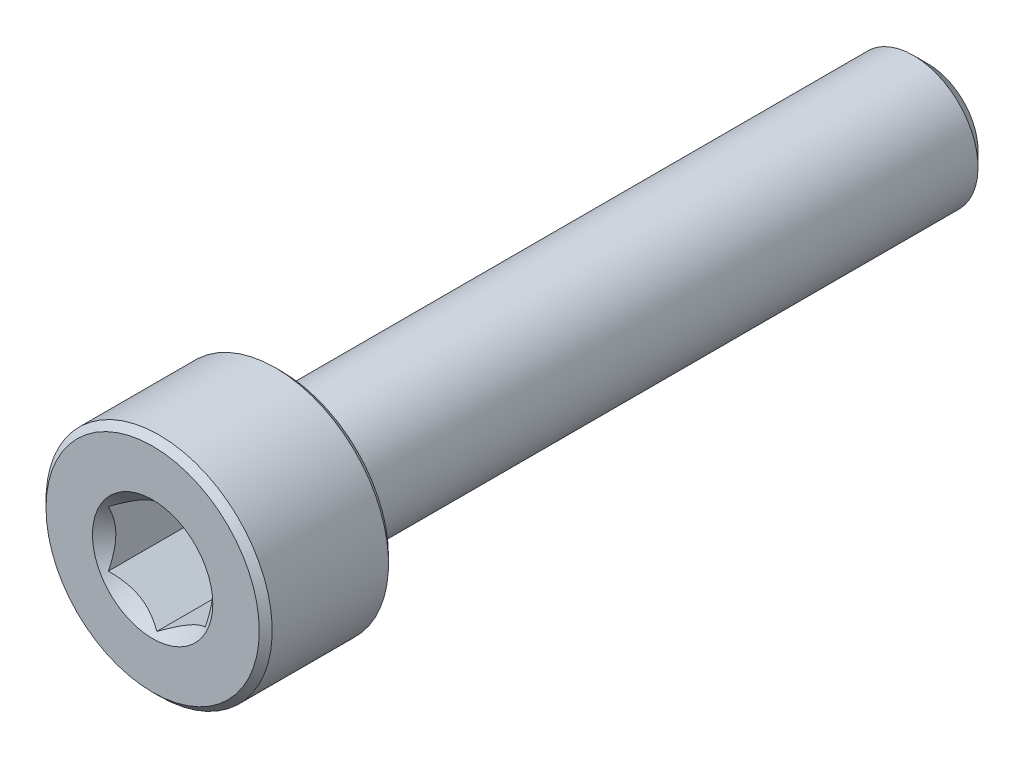
ISO-10303-21;
HEADER;
FILE_DESCRIPTION(('STEP AP214'),'2;1');
FILE_NAME('part.step','',(''),(''),'','','');
FILE_SCHEMA(('AUTOMOTIVE_DESIGN { 1 0 10303 214 1 1 1 1 }'));
ENDSEC;
DATA;
#1=APPLICATION_CONTEXT('core data for automotive mechanical design processes');
#2=APPLICATION_PROTOCOL_DEFINITION('international standard','automotive_design',2000,#1);
#3=PRODUCT_CONTEXT('',#1,'mechanical');
#4=PRODUCT('Part','Part','',(#3));
#5=PRODUCT_RELATED_PRODUCT_CATEGORY('part','',(#4));
#6=PRODUCT_DEFINITION_FORMATION('','',#4);
#7=PRODUCT_DEFINITION_CONTEXT('part definition',#1,'design');
#8=PRODUCT_DEFINITION('design','',#6,#7);
#9=PRODUCT_DEFINITION_SHAPE('','',#8);
#10=(LENGTH_UNIT() NAMED_UNIT(*) SI_UNIT(.MILLI.,.METRE.));
#11=(NAMED_UNIT(*) PLANE_ANGLE_UNIT() SI_UNIT($,.RADIAN.));
#12=(NAMED_UNIT(*) SI_UNIT($,.STERADIAN.) SOLID_ANGLE_UNIT());
#13=UNCERTAINTY_MEASURE_WITH_UNIT(LENGTH_MEASURE(1.E-05),#10,'distance_accuracy_value','');
#14=(GEOMETRIC_REPRESENTATION_CONTEXT(3) GLOBAL_UNCERTAINTY_ASSIGNED_CONTEXT((#13)) GLOBAL_UNIT_ASSIGNED_CONTEXT((#10,
#11,#12)) REPRESENTATION_CONTEXT('',''));
#15=CARTESIAN_POINT('',(0.,0.,0.));
#16=DIRECTION('',(0.,0.,1.));
#17=DIRECTION('',(1.,0.,0.));
#18=AXIS2_PLACEMENT_3D('',#15,#16,#17);
#19=CARTESIAN_POINT('',(0.,1.54533666301317,-12.));
#20=DIRECTION('',(0.,0.,-1.));
#21=DIRECTION('',(0.,1.,0.));
#22=AXIS2_PLACEMENT_3D('',#19,#20,#21);
#23=PLANE('',#22);
#24=CARTESIAN_POINT('',(0.,0.,-12.));
#25=DIRECTION('',(0.,0.,-1.));
#26=DIRECTION('',(0.,1.,0.));
#27=AXIS2_PLACEMENT_3D('',#24,#25,#26);
#28=CIRCLE('',#27,1.54533666301317);
#29=CARTESIAN_POINT('',(0.,1.54533666301317,-12.));
#30=VERTEX_POINT('',#29);
#31=EDGE_CURVE('E59',#30,#30,#28,.T.);
#32=ORIENTED_EDGE('',*,*,#31,.T.);
#33=EDGE_LOOP('',(#32));
#34=FACE_BOUND('',#33,.T.);
#35=ADVANCED_FACE('F45',(#34),#23,.T.);
#36=CARTESIAN_POINT('',(0.,0.,-12.));
#37=DIRECTION('',(0.,0.,1.));
#38=DIRECTION('',(0.,-1.,0.));
#39=AXIS2_PLACEMENT_3D('',#36,#37,#38);
#40=CONICAL_SURFACE('',#39,1.54533666301317,0.785398163397447);
#41=CARTESIAN_POINT('',(0.,0.,-11.5453366630132));
#42=DIRECTION('',(0.,0.,-1.));
#43=DIRECTION('',(0.,1.,0.));
#44=AXIS2_PLACEMENT_3D('',#41,#42,#43);
#45=CIRCLE('',#44,2.);
#46=CARTESIAN_POINT('',(0.,2.,-11.5453366630132));
#47=VERTEX_POINT('',#46);
#48=EDGE_CURVE('E177',#47,#47,#45,.T.);
#49=ORIENTED_EDGE('',*,*,#48,.T.);
#50=EDGE_LOOP('',(#49));
#51=FACE_BOUND('',#50,.T.);
#52=ORIENTED_EDGE('',*,*,#31,.F.);
#53=EDGE_LOOP('',(#52));
#54=FACE_BOUND('',#53,.T.);
#55=ADVANCED_FACE('F185',(#51,#54),#40,.T.);
#56=CARTESIAN_POINT('',(0.,0.,-12.));
#57=DIRECTION('',(0.,0.,-1.));
#58=DIRECTION('',(0.,1.,0.));
#59=AXIS2_PLACEMENT_3D('',#56,#57,#58);
#60=CYLINDRICAL_SURFACE('',#59,2.);
#61=CARTESIAN_POINT('',(0.,0.,7.8));
#62=DIRECTION('',(0.,0.,-1.));
#63=DIRECTION('',(0.,1.,0.));
#64=AXIS2_PLACEMENT_3D('',#61,#62,#63);
#65=CIRCLE('',#64,2.);
#66=CARTESIAN_POINT('',(0.,2.,7.8));
#67=VERTEX_POINT('',#66);
#68=EDGE_CURVE('E173',#67,#67,#65,.T.);
#69=ORIENTED_EDGE('',*,*,#68,.T.);
#70=EDGE_LOOP('',(#69));
#71=FACE_BOUND('',#70,.T.);
#72=ORIENTED_EDGE('',*,*,#48,.F.);
#73=EDGE_LOOP('',(#72));
#74=FACE_BOUND('',#73,.T.);
#75=ADVANCED_FACE('F187',(#71,#74),#60,.T.);
#76=CARTESIAN_POINT('',(0.,0.,7.8));
#77=DIRECTION('',(0.,0.,-1.));
#78=DIRECTION('',(0.,1.,0.));
#79=AXIS2_PLACEMENT_3D('',#76,#77,#78);
#80=TOROIDAL_SURFACE('',#79,2.2,0.2);
#81=CARTESIAN_POINT('',(0.,0.,8.));
#82=DIRECTION('',(0.,0.,-1.));
#83=DIRECTION('',(0.,1.,0.));
#84=AXIS2_PLACEMENT_3D('',#81,#82,#83);
#85=CIRCLE('',#84,2.2);
#86=CARTESIAN_POINT('',(0.,2.2,8.));
#87=VERTEX_POINT('',#86);
#88=EDGE_CURVE('E169',#87,#87,#85,.T.);
#89=ORIENTED_EDGE('',*,*,#88,.T.);
#90=EDGE_LOOP('',(#89));
#91=FACE_BOUND('',#90,.T.);
#92=ORIENTED_EDGE('',*,*,#68,.F.);
#93=EDGE_LOOP('',(#92));
#94=FACE_BOUND('',#93,.T.);
#95=ADVANCED_FACE('F193',(#91,#94),#80,.F.);
#96=CARTESIAN_POINT('',(0.,3.3,8.));
#97=DIRECTION('',(0.,0.,-1.));
#98=DIRECTION('',(0.,1.,0.));
#99=AXIS2_PLACEMENT_3D('',#96,#97,#98);
#100=PLANE('',#99);
#101=CARTESIAN_POINT('',(0.,0.,8.));
#102=DIRECTION('',(0.,0.,-1.));
#103=DIRECTION('',(0.,1.,0.));
#104=AXIS2_PLACEMENT_3D('',#101,#102,#103);
#105=CIRCLE('',#104,3.3);
#106=CARTESIAN_POINT('',(0.,3.3,8.));
#107=VERTEX_POINT('',#106);
#108=EDGE_CURVE('E165',#107,#107,#105,.T.);
#109=ORIENTED_EDGE('',*,*,#108,.T.);
#110=EDGE_LOOP('',(#109));
#111=FACE_BOUND('',#110,.T.);
#112=ORIENTED_EDGE('',*,*,#88,.F.);
#113=EDGE_LOOP('',(#112));
#114=FACE_BOUND('',#113,.T.);
#115=ADVANCED_FACE('F199',(#111,#114),#100,.T.);
#116=CARTESIAN_POINT('',(0.,0.,8.));
#117=DIRECTION('',(0.,0.,1.));
#118=DIRECTION('',(0.,-1.,0.));
#119=AXIS2_PLACEMENT_3D('',#116,#117,#118);
#120=CONICAL_SURFACE('',#119,3.3,0.785398163397443);
#121=CARTESIAN_POINT('',(0.,0.,8.2));
#122=DIRECTION('',(0.,0.,-1.));
#123=DIRECTION('',(0.,1.,0.));
#124=AXIS2_PLACEMENT_3D('',#121,#122,#123);
#125=CIRCLE('',#124,3.5);
#126=CARTESIAN_POINT('',(0.,3.5,8.2));
#127=VERTEX_POINT('',#126);
#128=EDGE_CURVE('E161',#127,#127,#125,.T.);
#129=ORIENTED_EDGE('',*,*,#128,.T.);
#130=EDGE_LOOP('',(#129));
#131=FACE_BOUND('',#130,.T.);
#132=ORIENTED_EDGE('',*,*,#108,.F.);
#133=EDGE_LOOP('',(#132));
#134=FACE_BOUND('',#133,.T.);
#135=ADVANCED_FACE('F203',(#131,#134),#120,.T.);
#136=CARTESIAN_POINT('',(0.,0.,-12.));
#137=DIRECTION('',(0.,0.,-1.));
#138=DIRECTION('',(0.,1.,0.));
#139=AXIS2_PLACEMENT_3D('',#136,#137,#138);
#140=CYLINDRICAL_SURFACE('',#139,3.5);
#141=CARTESIAN_POINT('',(0.,0.,11.8));
#142=DIRECTION('',(0.,0.,-1.));
#143=DIRECTION('',(0.,1.,0.));
#144=AXIS2_PLACEMENT_3D('',#141,#142,#143);
#145=CIRCLE('',#144,3.5);
#146=CARTESIAN_POINT('',(0.,3.5,11.8));
#147=VERTEX_POINT('',#146);
#148=EDGE_CURVE('E157',#147,#147,#145,.T.);
#149=ORIENTED_EDGE('',*,*,#148,.T.);
#150=EDGE_LOOP('',(#149));
#151=FACE_BOUND('',#150,.T.);
#152=ORIENTED_EDGE('',*,*,#128,.F.);
#153=EDGE_LOOP('',(#152));
#154=FACE_BOUND('',#153,.T.);
#155=ADVANCED_FACE('F207',(#151,#154),#140,.T.);
#156=CARTESIAN_POINT('',(0.,0.,11.8));
#157=DIRECTION('',(0.,0.,-1.));
#158=DIRECTION('',(0.,1.,0.));
#159=AXIS2_PLACEMENT_3D('',#156,#157,#158);
#160=CONICAL_SURFACE('',#159,3.5,0.785398163397452);
#161=CARTESIAN_POINT('',(0.,0.,12.));
#162=DIRECTION('',(0.,0.,-1.));
#163=DIRECTION('',(0.,1.,0.));
#164=AXIS2_PLACEMENT_3D('',#161,#162,#163);
#165=CIRCLE('',#164,3.3);
#166=CARTESIAN_POINT('',(0.,3.3,12.));
#167=VERTEX_POINT('',#166);
#168=EDGE_CURVE('E153',#167,#167,#165,.T.);
#169=ORIENTED_EDGE('',*,*,#168,.T.);
#170=EDGE_LOOP('',(#169));
#171=FACE_BOUND('',#170,.T.);
#172=ORIENTED_EDGE('',*,*,#148,.F.);
#173=EDGE_LOOP('',(#172));
#174=FACE_BOUND('',#173,.T.);
#175=ADVANCED_FACE('F211',(#171,#174),#160,.T.);
#176=CARTESIAN_POINT('',(0.,0.,12.));
#177=DIRECTION('',(0.,0.,1.));
#178=DIRECTION('',(0.,-1.,0.));
#179=AXIS2_PLACEMENT_3D('',#176,#177,#178);
#180=PLANE('',#179);
#181=CARTESIAN_POINT('',(0.,0.,12.));
#182=DIRECTION('',(0.,0.,1.));
#183=DIRECTION('',(1.,0.,0.));
#184=AXIS2_PLACEMENT_3D('',#181,#182,#183);
#185=CIRCLE('',#184,1.86195461813654);
#186=CARTESIAN_POINT('',(1.86195461813654,0.,12.));
#187=VERTEX_POINT('',#186);
#188=EDGE_CURVE('E119',#187,#187,#185,.T.);
#189=ORIENTED_EDGE('',*,*,#188,.F.);
#190=EDGE_LOOP('',(#189));
#191=FACE_BOUND('',#190,.T.);
#192=ORIENTED_EDGE('',*,*,#168,.F.);
#193=EDGE_LOOP('',(#192));
#194=FACE_BOUND('',#193,.T.);
#195=ADVANCED_FACE('F215',(#191,#194),#180,.T.);
#196=CARTESIAN_POINT('',(0.,0.,12.));
#197=DIRECTION('',(0.,0.,1.));
#198=DIRECTION('',(1.,0.,0.));
#199=AXIS2_PLACEMENT_3D('',#196,#197,#198);
#200=CONICAL_SURFACE('',#199,1.86195461813654,0.78539816339745);
#201=ORIENTED_EDGE('',*,*,#188,.T.);
#202=EDGE_LOOP('',(#201));
#203=FACE_BOUND('',#202,.T.);
#204=CARTESIAN_POINT('',(-0.000199999999999267,-1.73216627762272,11.8702116710324));
#205=CARTESIAN_POINT('',(0.0513677907370761,-1.70239359975915,11.8404616654997));
#206=CARTESIAN_POINT('',(0.103797917665201,-1.67212305186355,11.8124586733426));
#207=CARTESIAN_POINT('',(0.210709034055597,-1.61039789003619,11.7611854198725));
#208=CARTESIAN_POINT('',(0.265200195814661,-1.57893740312614,11.7379436944767));
#209=CARTESIAN_POINT('',(0.375079081357248,-1.51549879897987,11.6981299184246));
#210=CARTESIAN_POINT('',(0.4304388090952,-1.4835368452681,11.6814577751032));
#211=CARTESIAN_POINT('',(0.542377257477151,-1.41890915196211,11.6557706462504));
#212=CARTESIAN_POINT('',(0.598952556553009,-1.38624538781118,11.6467364799112));
#213=CARTESIAN_POINT('',(0.696455389516441,-1.32995210095299,11.6385852706592));
#214=CARTESIAN_POINT('',(0.737256908280466,-1.30639533311124,11.6373784424216));
#215=CARTESIAN_POINT('',(0.818787969615858,-1.25932335290193,11.6394102465946));
#216=CARTESIAN_POINT('',(0.85951749431463,-1.23580815085313,11.6426498601806));
#217=CARTESIAN_POINT('',(0.940584402163416,-1.18900414978427,11.6533881754143));
#218=CARTESIAN_POINT('',(0.980921384598288,-1.1657155821172,11.6608908424511));
#219=CARTESIAN_POINT('',(1.06091833691403,-1.11952932016335,11.6797478013606));
#220=CARTESIAN_POINT('',(1.10057800851621,-1.09663179808786,11.6911037464509));
#221=CARTESIAN_POINT('',(1.20216313477448,-1.03798159809698,11.724817837025));
#222=CARTESIAN_POINT('',(1.26345855370969,-1.00259267147465,11.7497180385257));
#223=CARTESIAN_POINT('',(1.35358562846331,-0.950557780604375,11.7917528427039));
#224=CARTESIAN_POINT('',(1.38328513990772,-0.933410759677148,11.8065213429914));
#225=CARTESIAN_POINT('',(1.44213790138375,-0.899432101996407,11.8374067553725));
#226=CARTESIAN_POINT('',(1.47129140422064,-0.88260031928571,11.853523023554));
#227=CARTESIAN_POINT('',(1.5002,-0.865909933730601,11.8702116710324));
#228=B_SPLINE_CURVE_WITH_KNOTS('',3,(#204,#205,#206,#207,#208,#209,#210,#211,#212,#213,#214,
#215,#216,#217,#218,#219,#220,#221,#222,#223,#224,#225,#226,#227),.UNSPECIFIED.,.F.,.F.,(4,2,2,
2,2,2,2,2,2,2,2,4),(0.,0.199829143693304,0.400822987382388,0.59862372053818,0.795926240188888,
0.93711306795988,1.07833105577193,1.21968061668222,1.36109089931054,1.58570969637565,
1.69770705470963,1.80965120737194),.UNSPECIFIED.);
#229=CARTESIAN_POINT('',(0.,-1.73205080756888,11.8700961894323));
#230=VERTEX_POINT('',#229);
#231=CARTESIAN_POINT('',(1.5,-0.866025403784439,11.8700961894323));
#232=VERTEX_POINT('',#231);
#233=EDGE_CURVE('E12',#230,#232,#228,.T.);
#234=ORIENTED_EDGE('',*,*,#233,.F.);
#235=CARTESIAN_POINT('',(-1.5002,-0.865909933730601,11.8702116710324));
#236=CARTESIAN_POINT('',(-1.44863220926292,-0.895682611594166,11.8404616654997));
#237=CARTESIAN_POINT('',(-1.3962020823348,-0.925953159489765,11.8124586733426));
#238=CARTESIAN_POINT('',(-1.2892909659444,-0.987678321317124,11.7611854198725));
#239=CARTESIAN_POINT('',(-1.23479980418534,-1.01913880822717,11.7379436944767));
#240=CARTESIAN_POINT('',(-1.12492091864275,-1.08257741237344,11.6981299184246));
#241=CARTESIAN_POINT('',(-1.0695611909048,-1.11453936608521,11.6814577751032));
#242=CARTESIAN_POINT('',(-0.95762274252285,-1.1791670593912,11.6557706462504));
#243=CARTESIAN_POINT('',(-0.901047443446992,-1.21183082354213,11.6467364799112));
#244=CARTESIAN_POINT('',(-0.80354461048356,-1.26812411040032,11.6385852706592));
#245=CARTESIAN_POINT('',(-0.762743091719534,-1.29168087824208,11.6373784424216));
#246=CARTESIAN_POINT('',(-0.681212030384142,-1.33875285845138,11.6394102465946));
#247=CARTESIAN_POINT('',(-0.640482505685371,-1.36226806050018,11.6426498601806));
#248=CARTESIAN_POINT('',(-0.559415597836584,-1.40907206156905,11.6533881754143));
#249=CARTESIAN_POINT('',(-0.519078615401712,-1.43236062923612,11.6608908424511));
#250=CARTESIAN_POINT('',(-0.439081663085969,-1.47854689118996,11.6797478013606));
#251=CARTESIAN_POINT('',(-0.399421991483792,-1.50144441326545,11.6911037464509));
#252=CARTESIAN_POINT('',(-0.297836865225515,-1.56009461325633,11.724817837025));
#253=CARTESIAN_POINT('',(-0.236541446290311,-1.59548353987866,11.7497180385257));
#254=CARTESIAN_POINT('',(-0.146414371536686,-1.64751843074894,11.7917528427039));
#255=CARTESIAN_POINT('',(-0.116714860092282,-1.66466545167617,11.8065213429914));
#256=CARTESIAN_POINT('',(-0.0578620986162489,-1.69864410935691,11.8374067553725));
#257=CARTESIAN_POINT('',(-0.0287085957793626,-1.71547589206761,11.853523023554));
#258=CARTESIAN_POINT('',(0.000200000000000409,-1.73216627762272,11.8702116710324));
#259=B_SPLINE_CURVE_WITH_KNOTS('',3,(#235,#236,#237,#238,#239,#240,#241,#242,#243,#244,#245,
#246,#247,#248,#249,#250,#251,#252,#253,#254,#255,#256,#257,#258),.UNSPECIFIED.,.F.,.F.,(4,2,2,
2,2,2,2,2,2,2,2,4),(0.,0.199829143693304,0.400822987382388,0.59862372053818,0.795926240188888,
0.93711306795988,1.07833105577193,1.21968061668222,1.36109089931054,1.58570969637565,
1.69770705470964,1.80965120737194),.UNSPECIFIED.);
#260=CARTESIAN_POINT('',(-1.5,-0.866025403784439,11.8700961894323));
#261=VERTEX_POINT('',#260);
#262=EDGE_CURVE('E104',#261,#230,#259,.T.);
#263=ORIENTED_EDGE('',*,*,#262,.F.);
#264=CARTESIAN_POINT('',(-1.5,-1.81798631684901,12.4949658829093));
#265=CARTESIAN_POINT('',(-1.5,-1.77410479833239,12.461123354197));
#266=CARTESIAN_POINT('',(-1.5,-1.72998897047494,12.427585617689));
#267=CARTESIAN_POINT('',(-1.5,-1.64119029432319,12.3612481734927));
#268=CARTESIAN_POINT('',(-1.5,-1.59650731534755,12.328448640911));
#269=CARTESIAN_POINT('',(-1.5,-1.460806940489,12.2308819314804));
#270=CARTESIAN_POINT('',(-1.5,-1.36880251235632,12.1674654206559));
#271=CARTESIAN_POINT('',(-1.5,-1.17526237686872,12.0421023717216));
#272=CARTESIAN_POINT('',(-1.5,-1.07349393006072,11.9805114153672));
#273=CARTESIAN_POINT('',(-1.5,-0.864764842560626,11.8672522059965));
#274=CARTESIAN_POINT('',(-1.5,-0.757823334449948,11.8155504395058));
#275=CARTESIAN_POINT('',(-1.5,-0.598146069886858,11.7522731736164));
#276=CARTESIAN_POINT('',(-1.5,-0.547969945491557,11.7342740839912));
#277=CARTESIAN_POINT('',(-1.5,-0.446326869364775,11.7022954652208));
#278=CARTESIAN_POINT('',(-1.5,-0.394859836419925,11.6883161896624));
#279=CARTESIAN_POINT('',(-1.5,-0.291848397493325,11.6653656903726));
#280=CARTESIAN_POINT('',(-1.5,-0.240324749628771,11.6563028154328));
#281=CARTESIAN_POINT('',(-1.5,-0.13662544851591,11.6433771152152));
#282=CARTESIAN_POINT('',(-1.5,-0.0844499362377799,11.6395131846234));
#283=CARTESIAN_POINT('',(-1.5,0.0176806967011133,11.6373196125689));
#284=CARTESIAN_POINT('',(-1.5,0.0676307045116619,11.6387500692366));
#285=CARTESIAN_POINT('',(-1.5,0.167145477637761,11.6465133142386));
#286=CARTESIAN_POINT('',(-1.5,0.216710207908514,11.6528465433779));
#287=CARTESIAN_POINT('',(-1.5,0.315937150651982,11.6701627170715));
#288=CARTESIAN_POINT('',(-1.5,0.365584733694538,11.6812281518103));
#289=CARTESIAN_POINT('',(-1.5,0.46378160619877,11.7073934991991));
#290=CARTESIAN_POINT('',(-1.5,0.512330953840259,11.7224931975855));
#291=CARTESIAN_POINT('',(-1.5,0.66131302328769,11.7746138556917));
#292=CARTESIAN_POINT('',(-1.5,0.759720789706277,11.8174049630424));
#293=CARTESIAN_POINT('',(-1.5,0.95194266902277,11.9126388372101));
#294=CARTESIAN_POINT('',(-1.5,1.04573912191844,11.9651155264859));
#295=CARTESIAN_POINT('',(-1.5,1.22504153577549,12.0734783373155));
#296=CARTESIAN_POINT('',(-1.5,1.3107282773288,12.1290691055441));
#297=CARTESIAN_POINT('',(-1.5,1.43696960041027,12.2150504562164));
#298=CARTESIAN_POINT('',(-1.5,1.47850725450332,12.2440226829709));
#299=CARTESIAN_POINT('',(-1.5,1.56101250374723,12.3027448839378));
#300=CARTESIAN_POINT('',(-1.5,1.60198025290925,12.3324946415183));
#301=CARTESIAN_POINT('',(-1.5,1.64271029717086,12.362567155286));
#302=B_SPLINE_CURVE_WITH_KNOTS('',3,(#264,#265,#266,#267,#268,#269,#270,#271,#272,#273,#274,
#275,#276,#277,#278,#279,#280,#281,#282,#283,#284,#285,#286,#287,#288,#289,#290,#291,#292,#293,
#294,#295,#296,#297,#298,#299,#300,#301),.UNSPECIFIED.,.F.,.F.,(4,2,2,2,2,2,2,2,2,2,2,2,2,2,2,2,
2,2,4),(0.,0.166243250325254,0.332525527595493,0.667617582874063,1.02421660314856,
1.37958485991001,1.53937185590112,1.69916892971772,1.85587466130012,2.01254707142443,
2.16220898927398,2.31188436469118,2.46428258498153,2.61667271286894,2.93766301623296,
3.25979964661299,3.56606529199602,3.71798989158864,3.86987260467919),.UNSPECIFIED.);
#303=CARTESIAN_POINT('',(-1.5,0.866025403784438,11.8700961894323));
#304=VERTEX_POINT('',#303);
#305=EDGE_CURVE('E118',#304,#261,#302,.F.);
#306=ORIENTED_EDGE('',*,*,#305,.F.);
#307=CARTESIAN_POINT('',(0.000199999999999471,1.73216627762272,11.8702116710324));
#308=CARTESIAN_POINT('',(-0.0513677907370762,1.70239359975915,11.8404616654997));
#309=CARTESIAN_POINT('',(-0.103797917665201,1.67212305186355,11.8124586733426));
#310=CARTESIAN_POINT('',(-0.210709034055597,1.61039789003619,11.7611854198725));
#311=CARTESIAN_POINT('',(-0.265200195814661,1.57893740312614,11.7379436944767));
#312=CARTESIAN_POINT('',(-0.375079081357249,1.51549879897987,11.6981299184246));
#313=CARTESIAN_POINT('',(-0.4304388090952,1.4835368452681,11.6814577751032));
#314=CARTESIAN_POINT('',(-0.54237725747715,1.41890915196211,11.6557706462504));
#315=CARTESIAN_POINT('',(-0.598952556553008,1.38624538781118,11.6467364799112));
#316=CARTESIAN_POINT('',(-0.69645538951644,1.329952100953,11.6385852706592));
#317=CARTESIAN_POINT('',(-0.737256908280466,1.30639533311124,11.6373784424216));
#318=CARTESIAN_POINT('',(-0.818787969615858,1.25932335290194,11.6394102465946));
#319=CARTESIAN_POINT('',(-0.859517494314629,1.23580815085313,11.6426498601806));
#320=CARTESIAN_POINT('',(-0.940584402163415,1.18900414978427,11.6533881754143));
#321=CARTESIAN_POINT('',(-0.980921384598287,1.1657155821172,11.6608908424511));
#322=CARTESIAN_POINT('',(-1.06091833691403,1.11952932016335,11.6797478013606));
#323=CARTESIAN_POINT('',(-1.10057800851621,1.09663179808786,11.6911037464509));
#324=CARTESIAN_POINT('',(-1.20216313477448,1.03798159809698,11.724817837025));
#325=CARTESIAN_POINT('',(-1.26345855370969,1.00259267147465,11.7497180385257));
#326=CARTESIAN_POINT('',(-1.35358562846331,0.950557780604375,11.7917528427039));
#327=CARTESIAN_POINT('',(-1.38328513990772,0.933410759677147,11.8065213429914));
#328=CARTESIAN_POINT('',(-1.44213790138375,0.899432101996407,11.8374067553725));
#329=CARTESIAN_POINT('',(-1.47129140422064,0.88260031928571,11.853523023554));
#330=CARTESIAN_POINT('',(-1.5002,0.8659099337306,11.8702116710324));
#331=B_SPLINE_CURVE_WITH_KNOTS('',3,(#307,#308,#309,#310,#311,#312,#313,#314,#315,#316,#317,
#318,#319,#320,#321,#322,#323,#324,#325,#326,#327,#328,#329,#330),.UNSPECIFIED.,.F.,.F.,(4,2,2,
2,2,2,2,2,2,2,2,4),(0.,0.199829143693305,0.400822987382388,0.59862372053818,0.795926240188888,
0.93711306795988,1.07833105577193,1.21968061668222,1.36109089931054,1.58570969637565,
1.69770705470964,1.80965120737194),.UNSPECIFIED.);
#332=CARTESIAN_POINT('',(0.,1.73205080756888,11.8700961894323));
#333=VERTEX_POINT('',#332);
#334=EDGE_CURVE('E266',#333,#304,#331,.T.);
#335=ORIENTED_EDGE('',*,*,#334,.F.);
#336=CARTESIAN_POINT('',(1.5002,0.865909933730601,11.8702116710324));
#337=CARTESIAN_POINT('',(1.44863220926292,0.895682611594166,11.8404616654997));
#338=CARTESIAN_POINT('',(1.3962020823348,0.925953159489765,11.8124586733426));
#339=CARTESIAN_POINT('',(1.2892909659444,0.987678321317124,11.7611854198725));
#340=CARTESIAN_POINT('',(1.23479980418534,1.01913880822718,11.7379436944767));
#341=CARTESIAN_POINT('',(1.12492091864275,1.08257741237344,11.6981299184246));
#342=CARTESIAN_POINT('',(1.0695611909048,1.11453936608521,11.6814577751032));
#343=CARTESIAN_POINT('',(0.957622742522849,1.1791670593912,11.6557706462504));
#344=CARTESIAN_POINT('',(0.901047443446992,1.21183082354213,11.6467364799112));
#345=CARTESIAN_POINT('',(0.803544610483559,1.26812411040032,11.6385852706592));
#346=CARTESIAN_POINT('',(0.762743091719534,1.29168087824208,11.6373784424216));
#347=CARTESIAN_POINT('',(0.681212030384142,1.33875285845138,11.6394102465946));
#348=CARTESIAN_POINT('',(0.64048250568537,1.36226806050018,11.6426498601806));
#349=CARTESIAN_POINT('',(0.559415597836584,1.40907206156905,11.6533881754143));
#350=CARTESIAN_POINT('',(0.519078615401712,1.43236062923612,11.6608908424511));
#351=CARTESIAN_POINT('',(0.439081663085969,1.47854689118996,11.6797478013606));
#352=CARTESIAN_POINT('',(0.399421991483792,1.50144441326545,11.6911037464509));
#353=CARTESIAN_POINT('',(0.297836865225515,1.56009461325633,11.724817837025));
#354=CARTESIAN_POINT('',(0.236541446290311,1.59548353987866,11.7497180385257));
#355=CARTESIAN_POINT('',(0.146414371536687,1.64751843074894,11.7917528427039));
#356=CARTESIAN_POINT('',(0.116714860092282,1.66466545167617,11.8065213429914));
#357=CARTESIAN_POINT('',(0.0578620986162492,1.69864410935691,11.8374067553725));
#358=CARTESIAN_POINT('',(0.0287085957793629,1.71547589206761,11.853523023554));
#359=CARTESIAN_POINT('',(-0.000200000000000123,1.73216627762272,11.8702116710324));
#360=B_SPLINE_CURVE_WITH_KNOTS('',3,(#336,#337,#338,#339,#340,#341,#342,#343,#344,#345,#346,
#347,#348,#349,#350,#351,#352,#353,#354,#355,#356,#357,#358,#359),.UNSPECIFIED.,.F.,.F.,(4,2,2,
2,2,2,2,2,2,2,2,4),(0.,0.199829143693305,0.400822987382389,0.598623720538181,0.795926240188889,
0.937113067959881,1.07833105577193,1.21968061668222,1.36109089931054,1.58570969637565,
1.69770705470964,1.80965120737194),.UNSPECIFIED.);
#361=CARTESIAN_POINT('',(1.5,0.866025403784439,11.8700961894323));
#362=VERTEX_POINT('',#361);
#363=EDGE_CURVE('E239',#362,#333,#360,.T.);
#364=ORIENTED_EDGE('',*,*,#363,.F.);
#365=CARTESIAN_POINT('',(1.5,-1.81798631684901,12.4949658829093));
#366=CARTESIAN_POINT('',(1.5,-1.77410479833238,12.461123354197));
#367=CARTESIAN_POINT('',(1.5,-1.72998897047494,12.427585617689));
#368=CARTESIAN_POINT('',(1.5,-1.64119029432319,12.3612481734927));
#369=CARTESIAN_POINT('',(1.5,-1.59650731534755,12.328448640911));
#370=CARTESIAN_POINT('',(1.5,-1.460806940489,12.2308819314804));
#371=CARTESIAN_POINT('',(1.5,-1.36880251235632,12.1674654206559));
#372=CARTESIAN_POINT('',(1.5,-1.17526237686872,12.0421023717216));
#373=CARTESIAN_POINT('',(1.5,-1.07349393006072,11.9805114153672));
#374=CARTESIAN_POINT('',(1.5,-0.864764842560626,11.8672522059965));
#375=CARTESIAN_POINT('',(1.5,-0.757823334449948,11.8155504395058));
#376=CARTESIAN_POINT('',(1.5,-0.598146069886857,11.7522731736164));
#377=CARTESIAN_POINT('',(1.5,-0.547969945491556,11.7342740839912));
#378=CARTESIAN_POINT('',(1.5,-0.446326869364773,11.7022954652208));
#379=CARTESIAN_POINT('',(1.5,-0.394859836419924,11.6883161896624));
#380=CARTESIAN_POINT('',(1.5,-0.291848397493324,11.6653656903726));
#381=CARTESIAN_POINT('',(1.5,-0.24032474962877,11.6563028154328));
#382=CARTESIAN_POINT('',(1.5,-0.13662544851591,11.6433771152152));
#383=CARTESIAN_POINT('',(1.5,-0.0844499362377794,11.6395131846234));
#384=CARTESIAN_POINT('',(1.5,0.0176806967011135,11.6373196125689));
#385=CARTESIAN_POINT('',(1.5,0.067630704511662,11.6387500692366));
#386=CARTESIAN_POINT('',(1.5,0.167145477637761,11.6465133142386));
#387=CARTESIAN_POINT('',(1.5,0.216710207908514,11.6528465433779));
#388=CARTESIAN_POINT('',(1.5,0.315937150651983,11.6701627170715));
#389=CARTESIAN_POINT('',(1.5,0.365584733694539,11.6812281518103));
#390=CARTESIAN_POINT('',(1.5,0.46378160619877,11.7073934991991));
#391=CARTESIAN_POINT('',(1.5,0.51233095384026,11.7224931975855));
#392=CARTESIAN_POINT('',(1.5,0.661313023287691,11.7746138556917));
#393=CARTESIAN_POINT('',(1.5,0.759720789706278,11.8174049630424));
#394=CARTESIAN_POINT('',(1.5,0.951942669022772,11.9126388372101));
#395=CARTESIAN_POINT('',(1.5,1.04573912191844,11.965115526486));
#396=CARTESIAN_POINT('',(1.5,1.22504153577549,12.0734783373155));
#397=CARTESIAN_POINT('',(1.5,1.3107282773288,12.1290691055441));
#398=CARTESIAN_POINT('',(1.5,1.43696960041028,12.2150504562164));
#399=CARTESIAN_POINT('',(1.5,1.47850725450332,12.2440226829709));
#400=CARTESIAN_POINT('',(1.5,1.56101250374723,12.3027448839378));
#401=CARTESIAN_POINT('',(1.5,1.60198025290925,12.3324946415183));
#402=CARTESIAN_POINT('',(1.5,1.64271029717086,12.362567155286));
#403=B_SPLINE_CURVE_WITH_KNOTS('',3,(#365,#366,#367,#368,#369,#370,#371,#372,#373,#374,#375,
#376,#377,#378,#379,#380,#381,#382,#383,#384,#385,#386,#387,#388,#389,#390,#391,#392,#393,#394,
#395,#396,#397,#398,#399,#400,#401,#402),.UNSPECIFIED.,.F.,.F.,(4,2,2,2,2,2,2,2,2,2,2,2,2,2,2,2,
2,2,4),(0.,0.166243250325254,0.332525527595493,0.667617582874063,1.02421660314856,
1.37958485991001,1.53937185590113,1.69916892971772,1.85587466130012,2.01254707142443,
2.16220898927398,2.31188436469118,2.46428258498153,2.61667271286894,2.93766301623296,
3.25979964661299,3.56606529199603,3.71798989158865,3.86987260467919),.UNSPECIFIED.);
#404=EDGE_CURVE('E66',#232,#362,#403,.T.);
#405=ORIENTED_EDGE('',*,*,#404,.F.);
#406=EDGE_LOOP('',(#234,#263,#306,#335,#364,#405));
#407=FACE_BOUND('',#406,.T.);
#408=ADVANCED_FACE('F103',(#203,#407),#200,.F.);
#409=CARTESIAN_POINT('',(0.,3.3,9.));
#410=DIRECTION('',(0.,0.,-1.));
#411=DIRECTION('',(0.,1.,0.));
#412=AXIS2_PLACEMENT_3D('',#409,#410,#411);
#413=PLANE('',#412);
#414=DIRECTION('',(0.866025403784438,0.5,0.));
#415=VECTOR('',#414,1.);
#416=CARTESIAN_POINT('',(0.,-1.73205080756888,9.));
#417=LINE('',#416,#415);
#418=CARTESIAN_POINT('',(0.,-1.73205080756888,9.));
#419=VERTEX_POINT('',#418);
#420=CARTESIAN_POINT('',(1.5,-0.866025403784439,9.));
#421=VERTEX_POINT('',#420);
#422=EDGE_CURVE('E122',#419,#421,#417,.T.);
#423=ORIENTED_EDGE('',*,*,#422,.T.);
#424=DIRECTION('',(0.,1.,0.));
#425=VECTOR('',#424,1.);
#426=CARTESIAN_POINT('',(1.5,-0.866025403784439,9.));
#427=LINE('',#426,#425);
#428=CARTESIAN_POINT('',(1.5,0.866025403784439,9.));
#429=VERTEX_POINT('',#428);
#430=EDGE_CURVE('E73',#421,#429,#427,.T.);
#431=ORIENTED_EDGE('',*,*,#430,.T.);
#432=DIRECTION('',(-0.866025403784439,0.5,0.));
#433=VECTOR('',#432,1.);
#434=CARTESIAN_POINT('',(1.5,0.866025403784439,9.));
#435=LINE('',#434,#433);
#436=CARTESIAN_POINT('',(0.,1.73205080756888,9.));
#437=VERTEX_POINT('',#436);
#438=EDGE_CURVE('E133',#429,#437,#435,.T.);
#439=ORIENTED_EDGE('',*,*,#438,.T.);
#440=DIRECTION('',(-0.866025403784439,-0.5,0.));
#441=VECTOR('',#440,1.);
#442=CARTESIAN_POINT('',(0.,1.73205080756888,9.));
#443=LINE('',#442,#441);
#444=CARTESIAN_POINT('',(-1.5,0.866025403784439,9.));
#445=VERTEX_POINT('',#444);
#446=EDGE_CURVE('E142',#437,#445,#443,.T.);
#447=ORIENTED_EDGE('',*,*,#446,.T.);
#448=DIRECTION('',(0.,-1.,0.));
#449=VECTOR('',#448,1.);
#450=CARTESIAN_POINT('',(-1.5,0.866025403784438,9.));
#451=LINE('',#450,#449);
#452=CARTESIAN_POINT('',(-1.5,-0.866025403784439,9.));
#453=VERTEX_POINT('',#452);
#454=EDGE_CURVE('E137',#445,#453,#451,.T.);
#455=ORIENTED_EDGE('',*,*,#454,.T.);
#456=DIRECTION('',(0.866025403784439,-0.5,0.));
#457=VECTOR('',#456,1.);
#458=CARTESIAN_POINT('',(-1.5,-0.866025403784439,9.));
#459=LINE('',#458,#457);
#460=EDGE_CURVE('E124',#453,#419,#459,.T.);
#461=ORIENTED_EDGE('',*,*,#460,.T.);
#462=EDGE_LOOP('',(#423,#431,#439,#447,#455,#461));
#463=FACE_BOUND('',#462,.T.);
#464=ADVANCED_FACE('F220',(#463),#413,.F.);
#465=CARTESIAN_POINT('',(0.,-1.73205080756888,3.41742430504416));
#466=DIRECTION('',(0.5,-0.866025403784438,0.));
#467=DIRECTION('',(0.866025403784438,0.5,0.));
#468=AXIS2_PLACEMENT_3D('',#465,#466,#467);
#469=PLANE('',#468);
#470=DIRECTION('',(0.,0.,1.));
#471=VECTOR('',#470,1.);
#472=CARTESIAN_POINT('',(0.,-1.73205080756888,3.41742430504416));
#473=LINE('',#472,#471);
#474=EDGE_CURVE('E113',#419,#230,#473,.T.);
#475=ORIENTED_EDGE('',*,*,#474,.T.);
#476=ORIENTED_EDGE('',*,*,#233,.T.);
#477=DIRECTION('',(0.,0.,1.));
#478=VECTOR('',#477,1.);
#479=CARTESIAN_POINT('',(1.5,-0.866025403784439,3.41742430504416));
#480=LINE('',#479,#478);
#481=EDGE_CURVE('E128',#421,#232,#480,.T.);
#482=ORIENTED_EDGE('',*,*,#481,.F.);
#483=ORIENTED_EDGE('',*,*,#422,.F.);
#484=EDGE_LOOP('',(#475,#476,#482,#483));
#485=FACE_BOUND('',#484,.T.);
#486=ADVANCED_FACE('F121',(#485),#469,.F.);
#487=CARTESIAN_POINT('',(-1.5,-0.866025403784439,3.41742430504416));
#488=DIRECTION('',(-0.5,-0.866025403784439,0.));
#489=DIRECTION('',(0.866025403784439,-0.5,0.));
#490=AXIS2_PLACEMENT_3D('',#487,#488,#489);
#491=PLANE('',#490);
#492=DIRECTION('',(0.,0.,1.));
#493=VECTOR('',#492,1.);
#494=CARTESIAN_POINT('',(-1.5,-0.866025403784439,3.41742430504416));
#495=LINE('',#494,#493);
#496=EDGE_CURVE('E116',#453,#261,#495,.T.);
#497=ORIENTED_EDGE('',*,*,#496,.T.);
#498=ORIENTED_EDGE('',*,*,#262,.T.);
#499=ORIENTED_EDGE('',*,*,#474,.F.);
#500=ORIENTED_EDGE('',*,*,#460,.F.);
#501=EDGE_LOOP('',(#497,#498,#499,#500));
#502=FACE_BOUND('',#501,.T.);
#503=ADVANCED_FACE('F112',(#502),#491,.F.);
#504=CARTESIAN_POINT('',(-1.5,0.866025403784438,3.41742430504416));
#505=DIRECTION('',(-1.,0.,0.));
#506=DIRECTION('',(0.,0.,1.));
#507=AXIS2_PLACEMENT_3D('',#504,#505,#506);
#508=PLANE('',#507);
#509=DIRECTION('',(0.,0.,1.));
#510=VECTOR('',#509,1.);
#511=CARTESIAN_POINT('',(-1.5,0.866025403784438,3.41742430504416));
#512=LINE('',#511,#510);
#513=EDGE_CURVE('E138',#445,#304,#512,.T.);
#514=ORIENTED_EDGE('',*,*,#513,.T.);
#515=ORIENTED_EDGE('',*,*,#305,.T.);
#516=ORIENTED_EDGE('',*,*,#496,.F.);
#517=ORIENTED_EDGE('',*,*,#454,.F.);
#518=EDGE_LOOP('',(#514,#515,#516,#517));
#519=FACE_BOUND('',#518,.T.);
#520=ADVANCED_FACE('F276',(#519),#508,.F.);
#521=CARTESIAN_POINT('',(0.,1.73205080756888,3.41742430504416));
#522=DIRECTION('',(-0.5,0.866025403784438,0.));
#523=DIRECTION('',(-0.866025403784439,-0.5,0.));
#524=AXIS2_PLACEMENT_3D('',#521,#522,#523);
#525=PLANE('',#524);
#526=DIRECTION('',(0.,0.,1.));
#527=VECTOR('',#526,1.);
#528=CARTESIAN_POINT('',(0.,1.73205080756888,3.41742430504416));
#529=LINE('',#528,#527);
#530=EDGE_CURVE('E143',#437,#333,#529,.T.);
#531=ORIENTED_EDGE('',*,*,#530,.T.);
#532=ORIENTED_EDGE('',*,*,#334,.T.);
#533=ORIENTED_EDGE('',*,*,#513,.F.);
#534=ORIENTED_EDGE('',*,*,#446,.F.);
#535=EDGE_LOOP('',(#531,#532,#533,#534));
#536=FACE_BOUND('',#535,.T.);
#537=ADVANCED_FACE('F273',(#536),#525,.F.);
#538=CARTESIAN_POINT('',(1.5,0.866025403784439,3.41742430504416));
#539=DIRECTION('',(0.5,0.866025403784439,0.));
#540=DIRECTION('',(-0.866025403784439,0.5,0.));
#541=AXIS2_PLACEMENT_3D('',#538,#539,#540);
#542=PLANE('',#541);
#543=DIRECTION('',(0.,0.,1.));
#544=VECTOR('',#543,1.);
#545=CARTESIAN_POINT('',(1.5,0.866025403784439,3.41742430504416));
#546=LINE('',#545,#544);
#547=EDGE_CURVE('E147',#429,#362,#546,.T.);
#548=ORIENTED_EDGE('',*,*,#547,.T.);
#549=ORIENTED_EDGE('',*,*,#363,.T.);
#550=ORIENTED_EDGE('',*,*,#530,.F.);
#551=ORIENTED_EDGE('',*,*,#438,.F.);
#552=EDGE_LOOP('',(#548,#549,#550,#551));
#553=FACE_BOUND('',#552,.T.);
#554=ADVANCED_FACE('F228',(#553),#542,.F.);
#555=CARTESIAN_POINT('',(1.5,-0.866025403784439,3.41742430504416));
#556=DIRECTION('',(1.,0.,0.));
#557=DIRECTION('',(0.,0.,-1.));
#558=AXIS2_PLACEMENT_3D('',#555,#556,#557);
#559=PLANE('',#558);
#560=ORIENTED_EDGE('',*,*,#481,.T.);
#561=ORIENTED_EDGE('',*,*,#404,.T.);
#562=ORIENTED_EDGE('',*,*,#547,.F.);
#563=ORIENTED_EDGE('',*,*,#430,.F.);
#564=EDGE_LOOP('',(#560,#561,#562,#563));
#565=FACE_BOUND('',#564,.T.);
#566=ADVANCED_FACE('F224',(#565),#559,.F.);
#567=CLOSED_SHELL('',(#35,#55,#75,#95,#115,#135,#155,#175,#195,#408,#464,#486,#503,#520,#537,
#554,#566));
#568=MANIFOLD_SOLID_BREP('B2',#567);
#569=ADVANCED_BREP_SHAPE_REPRESENTATION('',(#18,#568),#14);
#570=SHAPE_DEFINITION_REPRESENTATION(#9,#569);
ENDSEC;
END-ISO-10303-21;
